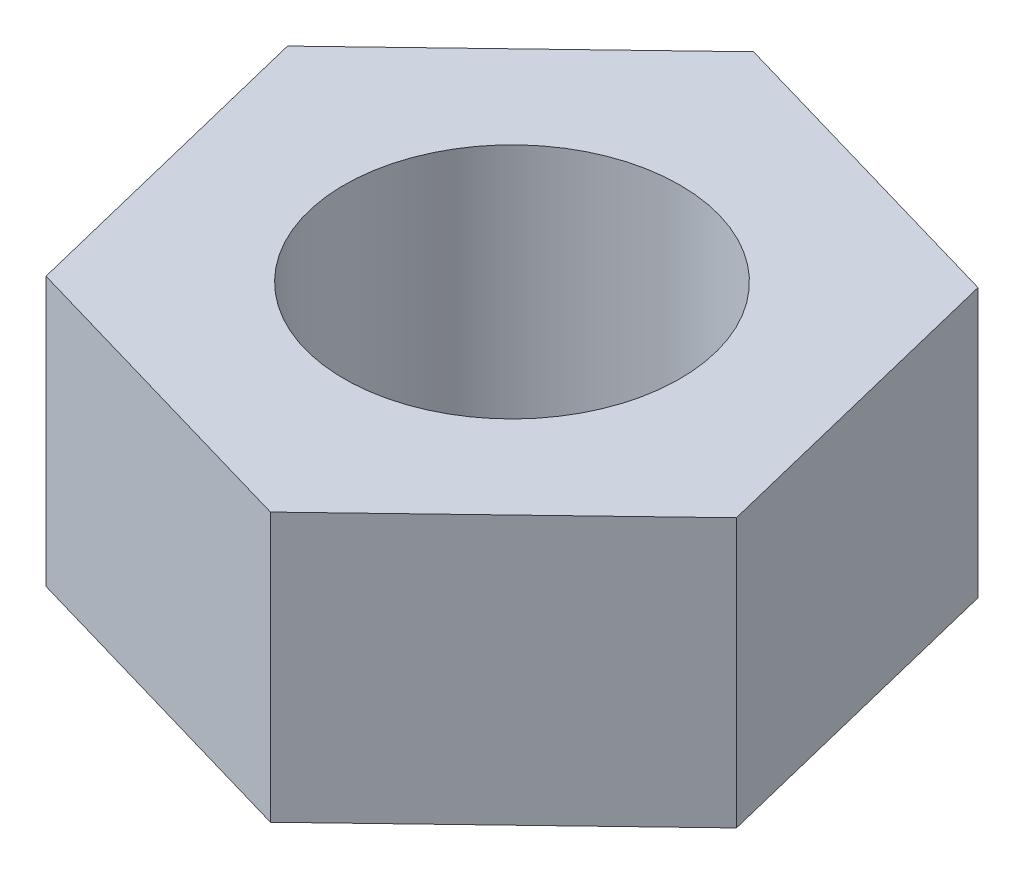
ISO-10303-21;
HEADER;
FILE_DESCRIPTION(('STEP AP214'),'2;1');
FILE_NAME('part.step','',(''),(''),'','','');
FILE_SCHEMA(('AUTOMOTIVE_DESIGN { 1 0 10303 214 1 1 1 1 }'));
ENDSEC;
DATA;
#1=APPLICATION_CONTEXT('core data for automotive mechanical design processes');
#2=APPLICATION_PROTOCOL_DEFINITION('international standard','automotive_design',2000,#1);
#3=PRODUCT_CONTEXT('',#1,'mechanical');
#4=PRODUCT('Part','Part','',(#3));
#5=PRODUCT_RELATED_PRODUCT_CATEGORY('part','',(#4));
#6=PRODUCT_DEFINITION_FORMATION('','',#4);
#7=PRODUCT_DEFINITION_CONTEXT('part definition',#1,'design');
#8=PRODUCT_DEFINITION('design','',#6,#7);
#9=PRODUCT_DEFINITION_SHAPE('','',#8);
#10=(LENGTH_UNIT() NAMED_UNIT(*) SI_UNIT(.MILLI.,.METRE.));
#11=(NAMED_UNIT(*) PLANE_ANGLE_UNIT() SI_UNIT($,.RADIAN.));
#12=(NAMED_UNIT(*) SI_UNIT($,.STERADIAN.) SOLID_ANGLE_UNIT());
#13=UNCERTAINTY_MEASURE_WITH_UNIT(LENGTH_MEASURE(1.E-05),#10,'distance_accuracy_value','');
#14=(GEOMETRIC_REPRESENTATION_CONTEXT(3) GLOBAL_UNCERTAINTY_ASSIGNED_CONTEXT((#13)) GLOBAL_UNIT_ASSIGNED_CONTEXT((#10,
#11,#12)) REPRESENTATION_CONTEXT('',''));
#15=CARTESIAN_POINT('',(0.,0.,0.));
#16=DIRECTION('',(0.,0.,1.));
#17=DIRECTION('',(1.,0.,0.));
#18=AXIS2_PLACEMENT_3D('',#15,#16,#17);
#19=CARTESIAN_POINT('',(7.08577612816405,8.,-6.79154695153276));
#20=DIRECTION('',(-0.279236000071997,0.,0.960222503518738));
#21=DIRECTION('',(0.960222503518738,0.,0.279236000071997));
#22=AXIS2_PLACEMENT_3D('',#19,#20,#21);
#23=PLANE('',#22);
#24=DIRECTION('',(-0.960222503518738,0.,-0.279236000071997));
#25=VECTOR('',#24,1.);
#26=CARTESIAN_POINT('',(7.08577612816405,0.,-6.79154695153276));
#27=LINE('',#26,#25);
#28=CARTESIAN_POINT('',(7.08577612816405,0.,-6.79154695153276));
#29=VERTEX_POINT('',#28);
#30=CARTESIAN_POINT('',(-2.3387641269401,0.,-9.53223560828579));
#31=VERTEX_POINT('',#30);
#32=EDGE_CURVE('E118',#29,#31,#27,.T.);
#33=ORIENTED_EDGE('',*,*,#32,.T.);
#34=DIRECTION('',(0.,-1.,0.));
#35=VECTOR('',#34,1.);
#36=CARTESIAN_POINT('',(-2.3387641269401,8.,-9.53223560828579));
#37=LINE('',#36,#35);
#38=CARTESIAN_POINT('',(-2.3387641269401,8.,-9.53223560828579));
#39=VERTEX_POINT('',#38);
#40=EDGE_CURVE('E11',#39,#31,#37,.T.);
#41=ORIENTED_EDGE('',*,*,#40,.F.);
#42=DIRECTION('',(-0.960222503518738,0.,-0.279236000071997));
#43=VECTOR('',#42,1.);
#44=CARTESIAN_POINT('',(7.08577612816405,8.,-6.79154695153276));
#45=LINE('',#44,#43);
#46=CARTESIAN_POINT('',(7.08577612816405,8.,-6.79154695153276));
#47=VERTEX_POINT('',#46);
#48=EDGE_CURVE('E129',#47,#39,#45,.T.);
#49=ORIENTED_EDGE('',*,*,#48,.F.);
#50=DIRECTION('',(0.,-1.,0.));
#51=VECTOR('',#50,1.);
#52=CARTESIAN_POINT('',(7.08577612816405,8.,-6.79154695153276));
#53=LINE('',#52,#51);
#54=EDGE_CURVE('E114',#47,#29,#53,.T.);
#55=ORIENTED_EDGE('',*,*,#54,.T.);
#56=EDGE_LOOP('',(#33,#41,#49,#55));
#57=FACE_BOUND('',#56,.T.);
#58=ADVANCED_FACE('F34',(#57),#23,.F.);
#59=CARTESIAN_POINT('',(-2.3387641269401,8.,-9.53223560828579));
#60=DIRECTION('',(0.69195908129672,0.,0.721936721472872));
#61=DIRECTION('',(0.721936721472872,0.,-0.69195908129672));
#62=AXIS2_PLACEMENT_3D('',#59,#60,#61);
#63=PLANE('',#62);
#64=DIRECTION('',(-0.721936721472872,0.,0.69195908129672));
#65=VECTOR('',#64,1.);
#66=CARTESIAN_POINT('',(-2.3387641269401,0.,-9.53223560828579));
#67=LINE('',#66,#65);
#68=CARTESIAN_POINT('',(-9.42454025510416,0.,-2.74068865675304));
#69=VERTEX_POINT('',#68);
#70=EDGE_CURVE('E121',#31,#69,#67,.T.);
#71=ORIENTED_EDGE('',*,*,#70,.T.);
#72=DIRECTION('',(0.,-1.,0.));
#73=VECTOR('',#72,1.);
#74=CARTESIAN_POINT('',(-9.42454025510416,8.,-2.74068865675304));
#75=LINE('',#74,#73);
#76=CARTESIAN_POINT('',(-9.42454025510416,8.,-2.74068865675304));
#77=VERTEX_POINT('',#76);
#78=EDGE_CURVE('E42',#77,#69,#75,.T.);
#79=ORIENTED_EDGE('',*,*,#78,.F.);
#80=DIRECTION('',(-0.721936721472872,0.,0.69195908129672));
#81=VECTOR('',#80,1.);
#82=CARTESIAN_POINT('',(-2.3387641269401,8.,-9.53223560828579));
#83=LINE('',#82,#81);
#84=EDGE_CURVE('E87',#39,#77,#83,.T.);
#85=ORIENTED_EDGE('',*,*,#84,.F.);
#86=ORIENTED_EDGE('',*,*,#40,.T.);
#87=EDGE_LOOP('',(#71,#79,#85,#86));
#88=FACE_BOUND('',#87,.T.);
#89=ADVANCED_FACE('F154',(#88),#63,.F.);
#90=CARTESIAN_POINT('',(-9.42454025510416,8.,-2.74068865675304));
#91=DIRECTION('',(0.971195081368718,0.,-0.238285782045866));
#92=DIRECTION('',(-0.238285782045866,0.,-0.971195081368718));
#93=AXIS2_PLACEMENT_3D('',#90,#91,#92);
#94=PLANE('',#93);
#95=DIRECTION('',(0.238285782045866,0.,0.971195081368718));
#96=VECTOR('',#95,1.);
#97=CARTESIAN_POINT('',(-9.42454025510416,0.,-2.74068865675304));
#98=LINE('',#97,#96);
#99=CARTESIAN_POINT('',(-7.08577612816405,0.,6.79154695153276));
#100=VERTEX_POINT('',#99);
#101=EDGE_CURVE('E124',#69,#100,#98,.T.);
#102=ORIENTED_EDGE('',*,*,#101,.T.);
#103=DIRECTION('',(0.,-1.,0.));
#104=VECTOR('',#103,1.);
#105=CARTESIAN_POINT('',(-7.08577612816405,8.,6.79154695153276));
#106=LINE('',#105,#104);
#107=CARTESIAN_POINT('',(-7.08577612816405,8.,6.79154695153276));
#108=VERTEX_POINT('',#107);
#109=EDGE_CURVE('E109',#108,#100,#106,.T.);
#110=ORIENTED_EDGE('',*,*,#109,.F.);
#111=DIRECTION('',(0.238285782045866,0.,0.971195081368718));
#112=VECTOR('',#111,1.);
#113=CARTESIAN_POINT('',(-9.42454025510416,8.,-2.74068865675304));
#114=LINE('',#113,#112);
#115=EDGE_CURVE('E100',#77,#108,#114,.T.);
#116=ORIENTED_EDGE('',*,*,#115,.F.);
#117=ORIENTED_EDGE('',*,*,#78,.T.);
#118=EDGE_LOOP('',(#102,#110,#116,#117));
#119=FACE_BOUND('',#118,.T.);
#120=ADVANCED_FACE('F135',(#119),#94,.F.);
#121=CARTESIAN_POINT('',(-7.08577612816405,8.,6.79154695153276));
#122=DIRECTION('',(0.279236000071997,0.,-0.960222503518737));
#123=DIRECTION('',(-0.960222503518738,0.,-0.279236000071997));
#124=AXIS2_PLACEMENT_3D('',#121,#122,#123);
#125=PLANE('',#124);
#126=DIRECTION('',(0.960222503518737,0.,0.279236000071997));
#127=VECTOR('',#126,1.);
#128=CARTESIAN_POINT('',(-7.08577612816405,0.,6.79154695153276));
#129=LINE('',#128,#127);
#130=CARTESIAN_POINT('',(2.3387641269401,0.,9.53223560828579));
#131=VERTEX_POINT('',#130);
#132=EDGE_CURVE('E108',#100,#131,#129,.T.);
#133=ORIENTED_EDGE('',*,*,#132,.T.);
#134=DIRECTION('',(0.,-1.,0.));
#135=VECTOR('',#134,1.);
#136=CARTESIAN_POINT('',(2.3387641269401,8.,9.53223560828579));
#137=LINE('',#136,#135);
#138=CARTESIAN_POINT('',(2.3387641269401,8.,9.53223560828579));
#139=VERTEX_POINT('',#138);
#140=EDGE_CURVE('E105',#139,#131,#137,.T.);
#141=ORIENTED_EDGE('',*,*,#140,.F.);
#142=DIRECTION('',(0.960222503518737,0.,0.279236000071997));
#143=VECTOR('',#142,1.);
#144=CARTESIAN_POINT('',(-7.08577612816405,8.,6.79154695153276));
#145=LINE('',#144,#143);
#146=EDGE_CURVE('E94',#108,#139,#145,.T.);
#147=ORIENTED_EDGE('',*,*,#146,.F.);
#148=ORIENTED_EDGE('',*,*,#109,.T.);
#149=EDGE_LOOP('',(#133,#141,#147,#148));
#150=FACE_BOUND('',#149,.T.);
#151=ADVANCED_FACE('F106',(#150),#125,.F.);
#152=CARTESIAN_POINT('',(2.3387641269401,8.,9.53223560828579));
#153=DIRECTION('',(-0.691959081296721,0.,-0.721936721472871));
#154=DIRECTION('',(-0.721936721472871,0.,0.691959081296721));
#155=AXIS2_PLACEMENT_3D('',#152,#153,#154);
#156=PLANE('',#155);
#157=DIRECTION('',(0.721936721472871,0.,-0.691959081296721));
#158=VECTOR('',#157,1.);
#159=CARTESIAN_POINT('',(2.3387641269401,0.,9.53223560828579));
#160=LINE('',#159,#158);
#161=CARTESIAN_POINT('',(9.42454025510416,0.,2.74068865675303));
#162=VERTEX_POINT('',#161);
#163=EDGE_CURVE('E73',#131,#162,#160,.T.);
#164=ORIENTED_EDGE('',*,*,#163,.T.);
#165=DIRECTION('',(0.,-1.,0.));
#166=VECTOR('',#165,1.);
#167=CARTESIAN_POINT('',(9.42454025510416,8.,2.74068865675303));
#168=LINE('',#167,#166);
#169=CARTESIAN_POINT('',(9.42454025510416,8.,2.74068865675303));
#170=VERTEX_POINT('',#169);
#171=EDGE_CURVE('E110',#170,#162,#168,.T.);
#172=ORIENTED_EDGE('',*,*,#171,.F.);
#173=DIRECTION('',(0.721936721472871,0.,-0.691959081296721));
#174=VECTOR('',#173,1.);
#175=CARTESIAN_POINT('',(2.3387641269401,8.,9.53223560828579));
#176=LINE('',#175,#174);
#177=EDGE_CURVE('E98',#139,#170,#176,.T.);
#178=ORIENTED_EDGE('',*,*,#177,.F.);
#179=ORIENTED_EDGE('',*,*,#140,.T.);
#180=EDGE_LOOP('',(#164,#172,#178,#179));
#181=FACE_BOUND('',#180,.T.);
#182=ADVANCED_FACE('F112',(#181),#156,.F.);
#183=CARTESIAN_POINT('',(9.42454025510416,8.,2.74068865675303));
#184=DIRECTION('',(-0.971195081368718,0.,0.238285782045866));
#185=DIRECTION('',(0.238285782045866,0.,0.971195081368718));
#186=AXIS2_PLACEMENT_3D('',#183,#184,#185);
#187=PLANE('',#186);
#188=DIRECTION('',(-0.238285782045866,0.,-0.971195081368718));
#189=VECTOR('',#188,1.);
#190=CARTESIAN_POINT('',(9.42454025510416,0.,2.74068865675303));
#191=LINE('',#190,#189);
#192=EDGE_CURVE('E79',#162,#29,#191,.T.);
#193=ORIENTED_EDGE('',*,*,#192,.T.);
#194=ORIENTED_EDGE('',*,*,#54,.F.);
#195=DIRECTION('',(-0.238285782045866,0.,-0.971195081368718));
#196=VECTOR('',#195,1.);
#197=CARTESIAN_POINT('',(9.42454025510416,8.,2.74068865675303));
#198=LINE('',#197,#196);
#199=EDGE_CURVE('E50',#170,#47,#198,.T.);
#200=ORIENTED_EDGE('',*,*,#199,.F.);
#201=ORIENTED_EDGE('',*,*,#171,.T.);
#202=EDGE_LOOP('',(#193,#194,#200,#201));
#203=FACE_BOUND('',#202,.T.);
#204=ADVANCED_FACE('F142',(#203),#187,.F.);
#205=CARTESIAN_POINT('',(0.,8.,0.));
#206=DIRECTION('',(0.,1.,0.));
#207=DIRECTION('',(0.,0.,1.));
#208=AXIS2_PLACEMENT_3D('',#205,#206,#207);
#209=PLANE('',#208);
#210=CARTESIAN_POINT('',(0.,8.,0.));
#211=DIRECTION('',(0.,-1.,0.));
#212=DIRECTION('',(0.,0.,-1.));
#213=AXIS2_PLACEMENT_3D('',#210,#211,#212);
#214=CIRCLE('',#213,5.);
#215=CARTESIAN_POINT('',(0.,8.,-5.));
#216=VERTEX_POINT('',#215);
#217=EDGE_CURVE('E122',#216,#216,#214,.T.);
#218=ORIENTED_EDGE('',*,*,#217,.T.);
#219=EDGE_LOOP('',(#218));
#220=FACE_BOUND('',#219,.T.);
#221=ORIENTED_EDGE('',*,*,#48,.T.);
#222=ORIENTED_EDGE('',*,*,#84,.T.);
#223=ORIENTED_EDGE('',*,*,#115,.T.);
#224=ORIENTED_EDGE('',*,*,#146,.T.);
#225=ORIENTED_EDGE('',*,*,#177,.T.);
#226=ORIENTED_EDGE('',*,*,#199,.T.);
#227=EDGE_LOOP('',(#221,#222,#223,#224,#225,#226));
#228=FACE_BOUND('',#227,.T.);
#229=ADVANCED_FACE('F96',(#220,#228),#209,.T.);
#230=CARTESIAN_POINT('',(0.,0.,0.));
#231=DIRECTION('',(0.,1.,0.));
#232=DIRECTION('',(0.,0.,1.));
#233=AXIS2_PLACEMENT_3D('',#230,#231,#232);
#234=PLANE('',#233);
#235=CARTESIAN_POINT('',(0.,0.,0.));
#236=DIRECTION('',(0.,-1.,0.));
#237=DIRECTION('',(0.,0.,-1.));
#238=AXIS2_PLACEMENT_3D('',#235,#236,#237);
#239=CIRCLE('',#238,5.);
#240=CARTESIAN_POINT('',(0.,0.,-5.));
#241=VERTEX_POINT('',#240);
#242=EDGE_CURVE('E209',#241,#241,#239,.T.);
#243=ORIENTED_EDGE('',*,*,#242,.F.);
#244=EDGE_LOOP('',(#243));
#245=FACE_BOUND('',#244,.T.);
#246=ORIENTED_EDGE('',*,*,#32,.F.);
#247=ORIENTED_EDGE('',*,*,#192,.F.);
#248=ORIENTED_EDGE('',*,*,#163,.F.);
#249=ORIENTED_EDGE('',*,*,#132,.F.);
#250=ORIENTED_EDGE('',*,*,#101,.F.);
#251=ORIENTED_EDGE('',*,*,#70,.F.);
#252=EDGE_LOOP('',(#246,#247,#248,#249,#250,#251));
#253=FACE_BOUND('',#252,.T.);
#254=ADVANCED_FACE('F138',(#245,#253),#234,.F.);
#255=CARTESIAN_POINT('',(0.,8.,0.));
#256=DIRECTION('',(0.,-1.,0.));
#257=DIRECTION('',(0.,0.,-1.));
#258=AXIS2_PLACEMENT_3D('',#255,#256,#257);
#259=CYLINDRICAL_SURFACE('',#258,5.);
#260=ORIENTED_EDGE('',*,*,#217,.F.);
#261=EDGE_LOOP('',(#260));
#262=FACE_BOUND('',#261,.T.);
#263=ORIENTED_EDGE('',*,*,#242,.T.);
#264=EDGE_LOOP('',(#263));
#265=FACE_BOUND('',#264,.T.);
#266=ADVANCED_FACE('F191',(#262,#265),#259,.F.);
#267=CLOSED_SHELL('',(#58,#89,#120,#151,#182,#204,#229,#254,#266));
#268=MANIFOLD_SOLID_BREP('B2',#267);
#269=ADVANCED_BREP_SHAPE_REPRESENTATION('',(#18,#268),#14);
#270=SHAPE_DEFINITION_REPRESENTATION(#9,#269);
ENDSEC;
END-ISO-10303-21;
